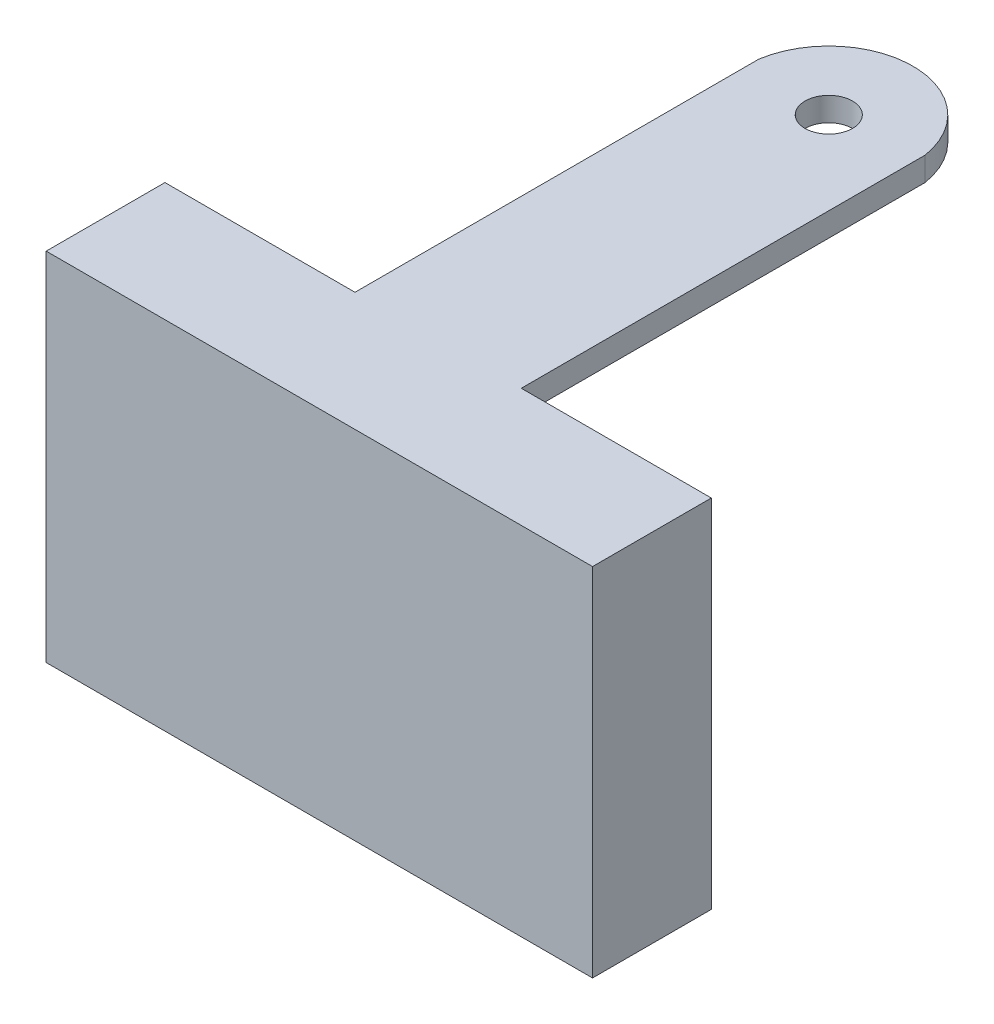
ISO-10303-21;
HEADER;
FILE_DESCRIPTION(('STEP AP214'),'2;1');
FILE_NAME('part.step','',(''),(''),'','','');
FILE_SCHEMA(('AUTOMOTIVE_DESIGN { 1 0 10303 214 1 1 1 1 }'));
ENDSEC;
DATA;
#1=APPLICATION_CONTEXT('core data for automotive mechanical design processes');
#2=APPLICATION_PROTOCOL_DEFINITION('international standard','automotive_design',2000,#1);
#3=PRODUCT_CONTEXT('',#1,'mechanical');
#4=PRODUCT('Part','Part','',(#3));
#5=PRODUCT_RELATED_PRODUCT_CATEGORY('part','',(#4));
#6=PRODUCT_DEFINITION_FORMATION('','',#4);
#7=PRODUCT_DEFINITION_CONTEXT('part definition',#1,'design');
#8=PRODUCT_DEFINITION('design','',#6,#7);
#9=PRODUCT_DEFINITION_SHAPE('','',#8);
#10=(LENGTH_UNIT() NAMED_UNIT(*) SI_UNIT(.MILLI.,.METRE.));
#11=(NAMED_UNIT(*) PLANE_ANGLE_UNIT() SI_UNIT($,.RADIAN.));
#12=(NAMED_UNIT(*) SI_UNIT($,.STERADIAN.) SOLID_ANGLE_UNIT());
#13=UNCERTAINTY_MEASURE_WITH_UNIT(LENGTH_MEASURE(1.E-05),#10,'distance_accuracy_value','');
#14=(GEOMETRIC_REPRESENTATION_CONTEXT(3) GLOBAL_UNCERTAINTY_ASSIGNED_CONTEXT((#13)) GLOBAL_UNIT_ASSIGNED_CONTEXT((#10,
#11,#12)) REPRESENTATION_CONTEXT('',''));
#15=CARTESIAN_POINT('',(0.,0.,0.));
#16=DIRECTION('',(0.,0.,1.));
#17=DIRECTION('',(1.,0.,0.));
#18=AXIS2_PLACEMENT_3D('',#15,#16,#17);
#19=CARTESIAN_POINT('',(-11.5,15.,-2.5));
#20=DIRECTION('',(0.,0.,1.));
#21=DIRECTION('',(1.,0.,0.));
#22=AXIS2_PLACEMENT_3D('',#19,#20,#21);
#23=PLANE('',#22);
#24=DIRECTION('',(0.,1.,0.));
#25=VECTOR('',#24,1.);
#26=CARTESIAN_POINT('',(-3.5,14.,-2.5));
#27=LINE('',#26,#25);
#28=CARTESIAN_POINT('',(-3.5,14.,-2.5));
#29=VERTEX_POINT('',#28);
#30=CARTESIAN_POINT('',(-3.5,15.,-2.5));
#31=VERTEX_POINT('',#30);
#32=EDGE_CURVE('E137',#29,#31,#27,.T.);
#33=ORIENTED_EDGE('',*,*,#32,.F.);
#34=DIRECTION('',(-1.,0.,0.));
#35=VECTOR('',#34,1.);
#36=CARTESIAN_POINT('',(0.,14.,-2.5));
#37=LINE('',#36,#35);
#38=CARTESIAN_POINT('',(3.5,14.,-2.5));
#39=VERTEX_POINT('',#38);
#40=EDGE_CURVE('E123',#39,#29,#37,.T.);
#41=ORIENTED_EDGE('',*,*,#40,.F.);
#42=DIRECTION('',(0.,1.,0.));
#43=VECTOR('',#42,1.);
#44=CARTESIAN_POINT('',(3.5,14.,-2.5));
#45=LINE('',#44,#43);
#46=CARTESIAN_POINT('',(3.5,15.,-2.5));
#47=VERTEX_POINT('',#46);
#48=EDGE_CURVE('E168',#39,#47,#45,.T.);
#49=ORIENTED_EDGE('',*,*,#48,.T.);
#50=DIRECTION('',(-1.,0.,0.));
#51=VECTOR('',#50,1.);
#52=CARTESIAN_POINT('',(-11.5,15.,-2.5));
#53=LINE('',#52,#51);
#54=CARTESIAN_POINT('',(11.5,15.,-2.5));
#55=VERTEX_POINT('',#54);
#56=EDGE_CURVE('E93',#55,#47,#53,.T.);
#57=ORIENTED_EDGE('',*,*,#56,.F.);
#58=DIRECTION('',(0.,-1.,0.));
#59=VECTOR('',#58,1.);
#60=CARTESIAN_POINT('',(11.5,15.,-2.5));
#61=LINE('',#60,#59);
#62=CARTESIAN_POINT('',(11.5,0.,-2.5));
#63=VERTEX_POINT('',#62);
#64=EDGE_CURVE('E11',#55,#63,#61,.T.);
#65=ORIENTED_EDGE('',*,*,#64,.T.);
#66=DIRECTION('',(-1.,0.,0.));
#67=VECTOR('',#66,1.);
#68=CARTESIAN_POINT('',(-11.5,0.,-2.5));
#69=LINE('',#68,#67);
#70=CARTESIAN_POINT('',(-11.5,0.,-2.5));
#71=VERTEX_POINT('',#70);
#72=EDGE_CURVE('E188',#63,#71,#69,.T.);
#73=ORIENTED_EDGE('',*,*,#72,.T.);
#74=DIRECTION('',(0.,-1.,0.));
#75=VECTOR('',#74,1.);
#76=CARTESIAN_POINT('',(-11.5,15.,-2.5));
#77=LINE('',#76,#75);
#78=CARTESIAN_POINT('',(-11.5,15.,-2.5));
#79=VERTEX_POINT('',#78);
#80=EDGE_CURVE('E50',#79,#71,#77,.T.);
#81=ORIENTED_EDGE('',*,*,#80,.F.);
#82=EDGE_CURVE('E176',#31,#79,#53,.T.);
#83=ORIENTED_EDGE('',*,*,#82,.F.);
#84=EDGE_LOOP('',(#33,#41,#49,#57,#65,#73,#81,#83));
#85=FACE_BOUND('',#84,.T.);
#86=ADVANCED_FACE('F41',(#85),#23,.F.);
#87=CARTESIAN_POINT('',(11.5,15.,-2.5));
#88=DIRECTION('',(-1.,0.,0.));
#89=DIRECTION('',(0.,0.,1.));
#90=AXIS2_PLACEMENT_3D('',#87,#88,#89);
#91=PLANE('',#90);
#92=DIRECTION('',(0.,0.,-1.));
#93=VECTOR('',#92,1.);
#94=CARTESIAN_POINT('',(11.5,0.,-2.5));
#95=LINE('',#94,#93);
#96=CARTESIAN_POINT('',(11.5,0.,2.5));
#97=VERTEX_POINT('',#96);
#98=EDGE_CURVE('E167',#97,#63,#95,.T.);
#99=ORIENTED_EDGE('',*,*,#98,.T.);
#100=ORIENTED_EDGE('',*,*,#64,.F.);
#101=DIRECTION('',(0.,0.,-1.));
#102=VECTOR('',#101,1.);
#103=CARTESIAN_POINT('',(11.5,15.,-2.5));
#104=LINE('',#103,#102);
#105=CARTESIAN_POINT('',(11.5,15.,2.5));
#106=VERTEX_POINT('',#105);
#107=EDGE_CURVE('E173',#106,#55,#104,.T.);
#108=ORIENTED_EDGE('',*,*,#107,.F.);
#109=DIRECTION('',(0.,-1.,0.));
#110=VECTOR('',#109,1.);
#111=CARTESIAN_POINT('',(11.5,15.,2.5));
#112=LINE('',#111,#110);
#113=EDGE_CURVE('E184',#106,#97,#112,.T.);
#114=ORIENTED_EDGE('',*,*,#113,.T.);
#115=EDGE_LOOP('',(#99,#100,#108,#114));
#116=FACE_BOUND('',#115,.T.);
#117=ADVANCED_FACE('F43',(#116),#91,.F.);
#118=CARTESIAN_POINT('',(-11.5,15.,-2.5));
#119=DIRECTION('',(1.,0.,0.));
#120=DIRECTION('',(0.,0.,-1.));
#121=AXIS2_PLACEMENT_3D('',#118,#119,#120);
#122=PLANE('',#121);
#123=DIRECTION('',(0.,0.,1.));
#124=VECTOR('',#123,1.);
#125=CARTESIAN_POINT('',(-11.5,0.,-2.5));
#126=LINE('',#125,#124);
#127=CARTESIAN_POINT('',(-11.5,0.,2.5));
#128=VERTEX_POINT('',#127);
#129=EDGE_CURVE('E191',#71,#128,#126,.T.);
#130=ORIENTED_EDGE('',*,*,#129,.T.);
#131=DIRECTION('',(0.,-1.,0.));
#132=VECTOR('',#131,1.);
#133=CARTESIAN_POINT('',(-11.5,15.,2.5));
#134=LINE('',#133,#132);
#135=CARTESIAN_POINT('',(-11.5,15.,2.5));
#136=VERTEX_POINT('',#135);
#137=EDGE_CURVE('E198',#136,#128,#134,.T.);
#138=ORIENTED_EDGE('',*,*,#137,.F.);
#139=DIRECTION('',(0.,0.,1.));
#140=VECTOR('',#139,1.);
#141=CARTESIAN_POINT('',(-11.5,15.,-2.5));
#142=LINE('',#141,#140);
#143=EDGE_CURVE('E179',#79,#136,#142,.T.);
#144=ORIENTED_EDGE('',*,*,#143,.F.);
#145=ORIENTED_EDGE('',*,*,#80,.T.);
#146=EDGE_LOOP('',(#130,#138,#144,#145));
#147=FACE_BOUND('',#146,.T.);
#148=ADVANCED_FACE('F206',(#147),#122,.F.);
#149=CARTESIAN_POINT('',(-11.5,15.,2.5));
#150=DIRECTION('',(0.,0.,-1.));
#151=DIRECTION('',(-1.,0.,0.));
#152=AXIS2_PLACEMENT_3D('',#149,#150,#151);
#153=PLANE('',#152);
#154=DIRECTION('',(1.,0.,0.));
#155=VECTOR('',#154,1.);
#156=CARTESIAN_POINT('',(-11.5,0.,2.5));
#157=LINE('',#156,#155);
#158=EDGE_CURVE('E87',#128,#97,#157,.T.);
#159=ORIENTED_EDGE('',*,*,#158,.T.);
#160=ORIENTED_EDGE('',*,*,#113,.F.);
#161=DIRECTION('',(1.,0.,0.));
#162=VECTOR('',#161,1.);
#163=CARTESIAN_POINT('',(-11.5,15.,2.5));
#164=LINE('',#163,#162);
#165=EDGE_CURVE('E66',#136,#106,#164,.T.);
#166=ORIENTED_EDGE('',*,*,#165,.F.);
#167=ORIENTED_EDGE('',*,*,#137,.T.);
#168=EDGE_LOOP('',(#159,#160,#166,#167));
#169=FACE_BOUND('',#168,.T.);
#170=ADVANCED_FACE('F215',(#169),#153,.F.);
#171=CARTESIAN_POINT('',(0.,15.,0.));
#172=DIRECTION('',(0.,1.,0.));
#173=DIRECTION('',(0.,0.,1.));
#174=AXIS2_PLACEMENT_3D('',#171,#172,#173);
#175=PLANE('',#174);
#176=ORIENTED_EDGE('',*,*,#107,.T.);
#177=ORIENTED_EDGE('',*,*,#56,.T.);
#178=DIRECTION('',(0.,0.,-1.));
#179=VECTOR('',#178,1.);
#180=CARTESIAN_POINT('',(3.5,15.,0.));
#181=LINE('',#180,#179);
#182=CARTESIAN_POINT('',(3.5,15.,-19.5));
#183=VERTEX_POINT('',#182);
#184=EDGE_CURVE('E57',#47,#183,#181,.T.);
#185=ORIENTED_EDGE('',*,*,#184,.T.);
#186=CARTESIAN_POINT('',(0.,15.,-18.9452320512138));
#187=DIRECTION('',(0.,1.,0.));
#188=DIRECTION('',(0.,0.,1.));
#189=AXIS2_PLACEMENT_3D('',#186,#187,#188);
#190=CIRCLE('',#189,3.54369404393219);
#191=CARTESIAN_POINT('',(-3.5,15.,-19.5));
#192=VERTEX_POINT('',#191);
#193=EDGE_CURVE('E158',#192,#183,#190,.F.);
#194=ORIENTED_EDGE('',*,*,#193,.F.);
#195=DIRECTION('',(0.,0.,-1.));
#196=VECTOR('',#195,1.);
#197=CARTESIAN_POINT('',(-3.5,15.,0.));
#198=LINE('',#197,#196);
#199=EDGE_CURVE('E132',#31,#192,#198,.T.);
#200=ORIENTED_EDGE('',*,*,#199,.F.);
#201=ORIENTED_EDGE('',*,*,#82,.T.);
#202=ORIENTED_EDGE('',*,*,#143,.T.);
#203=ORIENTED_EDGE('',*,*,#165,.T.);
#204=EDGE_LOOP('',(#176,#177,#185,#194,#200,#201,#202,#203));
#205=FACE_BOUND('',#204,.T.);
#206=CARTESIAN_POINT('',(0.,15.,-18.9452320512138));
#207=DIRECTION('',(0.,1.,0.));
#208=DIRECTION('',(0.,0.,1.));
#209=AXIS2_PLACEMENT_3D('',#206,#207,#208);
#210=CIRCLE('',#209,1.);
#211=CARTESIAN_POINT('',(0.,15.,-17.9452320512138));
#212=VERTEX_POINT('',#211);
#213=EDGE_CURVE('E154',#212,#212,#210,.T.);
#214=ORIENTED_EDGE('',*,*,#213,.F.);
#215=EDGE_LOOP('',(#214));
#216=FACE_BOUND('',#215,.T.);
#217=ADVANCED_FACE('F217',(#205,#216),#175,.T.);
#218=CARTESIAN_POINT('',(0.,0.,0.));
#219=DIRECTION('',(0.,1.,0.));
#220=DIRECTION('',(0.,0.,1.));
#221=AXIS2_PLACEMENT_3D('',#218,#219,#220);
#222=PLANE('',#221);
#223=ORIENTED_EDGE('',*,*,#98,.F.);
#224=ORIENTED_EDGE('',*,*,#158,.F.);
#225=ORIENTED_EDGE('',*,*,#129,.F.);
#226=ORIENTED_EDGE('',*,*,#72,.F.);
#227=EDGE_LOOP('',(#223,#224,#225,#226));
#228=FACE_BOUND('',#227,.T.);
#229=ADVANCED_FACE('F211',(#228),#222,.F.);
#230=CARTESIAN_POINT('',(0.,14.,-18.9452320512138));
#231=DIRECTION('',(0.,1.,0.));
#232=DIRECTION('',(0.,0.,1.));
#233=AXIS2_PLACEMENT_3D('',#230,#231,#232);
#234=CYLINDRICAL_SURFACE('',#233,3.54369404393219);
#235=ORIENTED_EDGE('',*,*,#193,.T.);
#236=DIRECTION('',(0.,1.,0.));
#237=VECTOR('',#236,1.);
#238=CARTESIAN_POINT('',(3.5,14.,-19.5));
#239=LINE('',#238,#237);
#240=CARTESIAN_POINT('',(3.5,14.,-19.5));
#241=VERTEX_POINT('',#240);
#242=EDGE_CURVE('E141',#241,#183,#239,.T.);
#243=ORIENTED_EDGE('',*,*,#242,.F.);
#244=CARTESIAN_POINT('',(0.,14.,-18.9452320512138));
#245=DIRECTION('',(0.,1.,0.));
#246=DIRECTION('',(0.,0.,1.));
#247=AXIS2_PLACEMENT_3D('',#244,#245,#246);
#248=CIRCLE('',#247,3.54369404393219);
#249=CARTESIAN_POINT('',(-3.5,14.,-19.5));
#250=VERTEX_POINT('',#249);
#251=EDGE_CURVE('E120',#250,#241,#248,.F.);
#252=ORIENTED_EDGE('',*,*,#251,.F.);
#253=DIRECTION('',(0.,1.,0.));
#254=VECTOR('',#253,1.);
#255=CARTESIAN_POINT('',(-3.5,14.,-19.5));
#256=LINE('',#255,#254);
#257=EDGE_CURVE('E129',#250,#192,#256,.T.);
#258=ORIENTED_EDGE('',*,*,#257,.T.);
#259=EDGE_LOOP('',(#235,#243,#252,#258));
#260=FACE_BOUND('',#259,.T.);
#261=ADVANCED_FACE('F140',(#260),#234,.T.);
#262=CARTESIAN_POINT('',(3.5,14.,0.));
#263=DIRECTION('',(1.,0.,0.));
#264=DIRECTION('',(0.,0.,-1.));
#265=AXIS2_PLACEMENT_3D('',#262,#263,#264);
#266=PLANE('',#265);
#267=ORIENTED_EDGE('',*,*,#184,.F.);
#268=ORIENTED_EDGE('',*,*,#48,.F.);
#269=DIRECTION('',(0.,0.,-1.));
#270=VECTOR('',#269,1.);
#271=CARTESIAN_POINT('',(3.5,14.,0.));
#272=LINE('',#271,#270);
#273=EDGE_CURVE('E138',#39,#241,#272,.T.);
#274=ORIENTED_EDGE('',*,*,#273,.T.);
#275=ORIENTED_EDGE('',*,*,#242,.T.);
#276=EDGE_LOOP('',(#267,#268,#274,#275));
#277=FACE_BOUND('',#276,.T.);
#278=ADVANCED_FACE('F236',(#277),#266,.T.);
#279=CARTESIAN_POINT('',(0.,14.,-18.9452320512138));
#280=DIRECTION('',(0.,1.,0.));
#281=DIRECTION('',(0.,0.,1.));
#282=AXIS2_PLACEMENT_3D('',#279,#280,#281);
#283=CYLINDRICAL_SURFACE('',#282,1.);
#284=CARTESIAN_POINT('',(0.,14.,-18.9452320512138));
#285=DIRECTION('',(0.,1.,0.));
#286=DIRECTION('',(0.,0.,1.));
#287=AXIS2_PLACEMENT_3D('',#284,#285,#286);
#288=CIRCLE('',#287,1.);
#289=CARTESIAN_POINT('',(0.,14.,-17.9452320512138));
#290=VERTEX_POINT('',#289);
#291=EDGE_CURVE('E144',#290,#290,#288,.T.);
#292=ORIENTED_EDGE('',*,*,#291,.F.);
#293=EDGE_LOOP('',(#292));
#294=FACE_BOUND('',#293,.T.);
#295=ORIENTED_EDGE('',*,*,#213,.T.);
#296=EDGE_LOOP('',(#295));
#297=FACE_BOUND('',#296,.T.);
#298=ADVANCED_FACE('F234',(#294,#297),#283,.F.);
#299=CARTESIAN_POINT('',(-3.5,14.,0.));
#300=DIRECTION('',(1.,0.,0.));
#301=DIRECTION('',(0.,0.,-1.));
#302=AXIS2_PLACEMENT_3D('',#299,#300,#301);
#303=PLANE('',#302);
#304=ORIENTED_EDGE('',*,*,#199,.T.);
#305=ORIENTED_EDGE('',*,*,#257,.F.);
#306=DIRECTION('',(0.,0.,-1.));
#307=VECTOR('',#306,1.);
#308=CARTESIAN_POINT('',(-3.5,14.,0.));
#309=LINE('',#308,#307);
#310=EDGE_CURVE('E115',#29,#250,#309,.T.);
#311=ORIENTED_EDGE('',*,*,#310,.F.);
#312=ORIENTED_EDGE('',*,*,#32,.T.);
#313=EDGE_LOOP('',(#304,#305,#311,#312));
#314=FACE_BOUND('',#313,.T.);
#315=ADVANCED_FACE('F130',(#314),#303,.F.);
#316=CARTESIAN_POINT('',(0.,14.,0.));
#317=DIRECTION('',(0.,1.,0.));
#318=DIRECTION('',(0.,0.,1.));
#319=AXIS2_PLACEMENT_3D('',#316,#317,#318);
#320=PLANE('',#319);
#321=ORIENTED_EDGE('',*,*,#291,.T.);
#322=EDGE_LOOP('',(#321));
#323=FACE_BOUND('',#322,.T.);
#324=ORIENTED_EDGE('',*,*,#251,.T.);
#325=ORIENTED_EDGE('',*,*,#273,.F.);
#326=ORIENTED_EDGE('',*,*,#40,.T.);
#327=ORIENTED_EDGE('',*,*,#310,.T.);
#328=EDGE_LOOP('',(#324,#325,#326,#327));
#329=FACE_BOUND('',#328,.T.);
#330=ADVANCED_FACE('F117',(#323,#329),#320,.F.);
#331=CLOSED_SHELL('',(#86,#117,#148,#170,#217,#229,#261,#278,#298,#315,#330));
#332=MANIFOLD_SOLID_BREP('B2',#331);
#333=ADVANCED_BREP_SHAPE_REPRESENTATION('',(#18,#332),#14);
#334=SHAPE_DEFINITION_REPRESENTATION(#9,#333);
ENDSEC;
END-ISO-10303-21;
